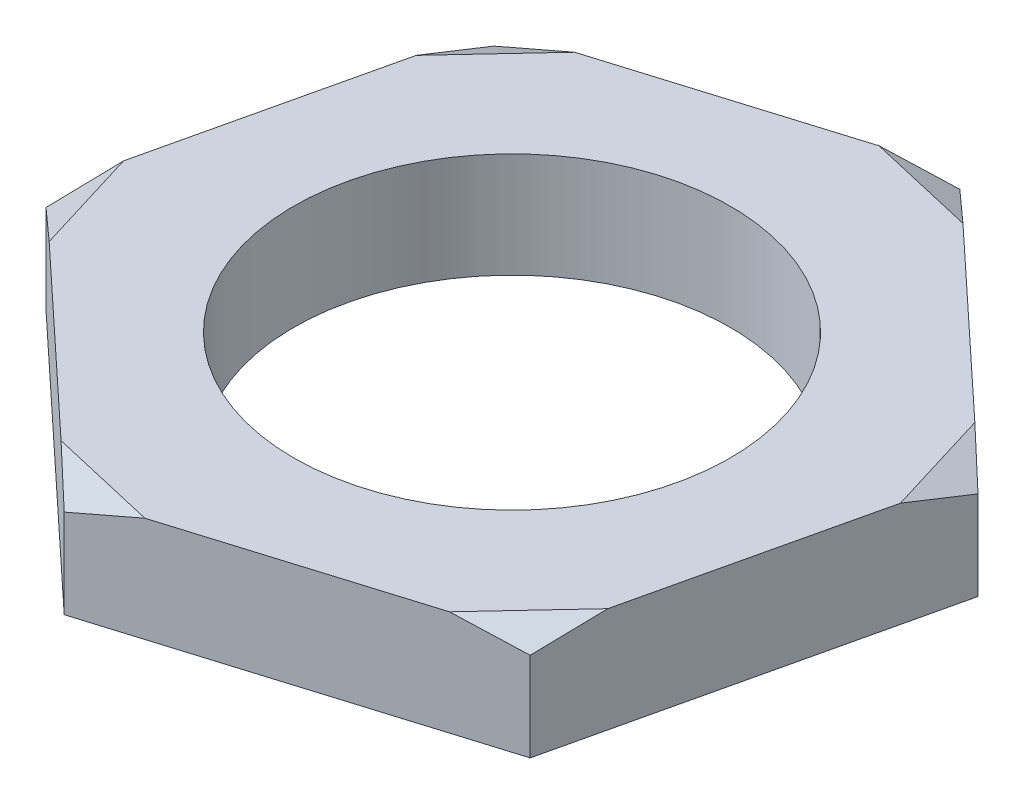
ISO-10303-21;
HEADER;
FILE_DESCRIPTION(('STEP AP214'),'2;1');
FILE_NAME('part.step','',(''),(''),'','','');
FILE_SCHEMA(('AUTOMOTIVE_DESIGN { 1 0 10303 214 1 1 1 1 }'));
ENDSEC;
DATA;
#1=APPLICATION_CONTEXT('core data for automotive mechanical design processes');
#2=APPLICATION_PROTOCOL_DEFINITION('international standard','automotive_design',2000,#1);
#3=PRODUCT_CONTEXT('',#1,'mechanical');
#4=PRODUCT('Part','Part','',(#3));
#5=PRODUCT_RELATED_PRODUCT_CATEGORY('part','',(#4));
#6=PRODUCT_DEFINITION_FORMATION('','',#4);
#7=PRODUCT_DEFINITION_CONTEXT('part definition',#1,'design');
#8=PRODUCT_DEFINITION('design','',#6,#7);
#9=PRODUCT_DEFINITION_SHAPE('','',#8);
#10=(LENGTH_UNIT() NAMED_UNIT(*) SI_UNIT(.MILLI.,.METRE.));
#11=(NAMED_UNIT(*) PLANE_ANGLE_UNIT() SI_UNIT($,.RADIAN.));
#12=(NAMED_UNIT(*) SI_UNIT($,.STERADIAN.) SOLID_ANGLE_UNIT());
#13=UNCERTAINTY_MEASURE_WITH_UNIT(LENGTH_MEASURE(1.E-05),#10,'distance_accuracy_value','');
#14=(GEOMETRIC_REPRESENTATION_CONTEXT(3) GLOBAL_UNCERTAINTY_ASSIGNED_CONTEXT((#13)) GLOBAL_UNIT_ASSIGNED_CONTEXT((#10,
#11,#12)) REPRESENTATION_CONTEXT('',''));
#15=CARTESIAN_POINT('',(0.,0.,0.));
#16=DIRECTION('',(0.,0.,1.));
#17=DIRECTION('',(1.,0.,0.));
#18=AXIS2_PLACEMENT_3D('',#15,#16,#17);
#19=CARTESIAN_POINT('',(0.,1.3,0.));
#20=DIRECTION('',(0.,1.,0.));
#21=DIRECTION('',(0.,0.,1.));
#22=AXIS2_PLACEMENT_3D('',#19,#20,#21);
#23=PLANE('',#22);
#24=CARTESIAN_POINT('',(0.,1.3,0.));
#25=DIRECTION('',(0.,1.,0.));
#26=DIRECTION('',(0.,0.,1.));
#27=AXIS2_PLACEMENT_3D('',#24,#25,#26);
#28=CIRCLE('',#27,2.7);
#29=CARTESIAN_POINT('',(0.,1.3,2.7));
#30=VERTEX_POINT('',#29);
#31=EDGE_CURVE('E204',#30,#30,#28,.T.);
#32=ORIENTED_EDGE('',*,*,#31,.F.);
#33=EDGE_LOOP('',(#32));
#34=FACE_BOUND('',#33,.T.);
#35=DIRECTION('',(-0.731076522641748,0.,-0.682295477078699));
#36=VECTOR('',#35,1.);
#37=CARTESIAN_POINT('',(4.41753081689651,1.3,-1.34861218113399));
#38=LINE('',#37,#36);
#39=CARTESIAN_POINT('',(3.83266959878311,1.3,-1.89444856279695));
#40=VERTEX_POINT('',#39);
#41=CARTESIAN_POINT('',(1.62569421784648,1.3,-3.95416361833704));
#42=VERTEX_POINT('',#41);
#43=EDGE_CURVE('E126',#40,#42,#38,.T.);
#44=ORIENTED_EDGE('',*,*,#43,.T.);
#45=DIRECTION('',(-0.974278579257493,0.,-0.225346954716502));
#46=VECTOR('',#45,1.);
#47=CARTESIAN_POINT('',(0.950694217846479,1.3,-4.110288568297));
#48=LINE('',#47,#46);
#49=CARTESIAN_POINT('',(0.275694217846484,1.3,-4.26641351825697));
#50=VERTEX_POINT('',#49);
#51=EDGE_CURVE('E41',#42,#50,#48,.T.);
#52=ORIENTED_EDGE('',*,*,#51,.T.);
#53=DIRECTION('',(-0.956423477358251,0.,0.291983102178794));
#54=VECTOR('',#53,1.);
#55=CARTESIAN_POINT('',(1.04083299973308,1.3,-4.5));
#56=LINE('',#55,#54);
#57=CARTESIAN_POINT('',(-2.61155903527684,1.3,-3.38497430060904));
#58=VERTEX_POINT('',#57);
#59=EDGE_CURVE('E131',#50,#58,#56,.T.);
#60=ORIENTED_EDGE('',*,*,#59,.T.);
#61=DIRECTION('',(0.682295477078699,0.,-0.731076522641749));
#62=VECTOR('',#61,1.);
#63=CARTESIAN_POINT('',(-3.08426720810674,1.3,-2.87846962803453));
#64=LINE('',#63,#62);
#65=CARTESIAN_POINT('',(-3.55697538093663,1.3,-2.37196495546002));
#66=VERTEX_POINT('',#65);
#67=EDGE_CURVE('E141',#66,#58,#64,.T.);
#68=ORIENTED_EDGE('',*,*,#67,.F.);
#69=DIRECTION('',(-0.225346954716502,0.,0.974278579257493));
#70=VECTOR('',#69,1.);
#71=CARTESIAN_POINT('',(-3.37669781716343,1.3,-3.15138781886601));
#72=LINE('',#71,#70);
#73=CARTESIAN_POINT('',(-4.23725325312331,1.3,0.569189317727997));
#74=VERTEX_POINT('',#73);
#75=EDGE_CURVE('E213',#66,#74,#72,.T.);
#76=ORIENTED_EDGE('',*,*,#75,.T.);
#77=DIRECTION('',(0.291983102178794,0.,0.95642347735825));
#78=VECTOR('',#77,1.);
#79=CARTESIAN_POINT('',(-4.03496142595321,1.3,1.23181894026247));
#80=LINE('',#79,#78);
#81=CARTESIAN_POINT('',(-3.83266959878311,1.3,1.89444856279695));
#82=VERTEX_POINT('',#81);
#83=EDGE_CURVE('E150',#74,#82,#80,.T.);
#84=ORIENTED_EDGE('',*,*,#83,.T.);
#85=DIRECTION('',(0.731076522641748,0.,0.682295477078699));
#86=VECTOR('',#85,1.);
#87=CARTESIAN_POINT('',(-4.41753081689651,1.3,1.34861218113399));
#88=LINE('',#87,#86);
#89=CARTESIAN_POINT('',(-1.62569421784647,1.3,3.95416361833704));
#90=VERTEX_POINT('',#89);
#91=EDGE_CURVE('E211',#82,#90,#88,.T.);
#92=ORIENTED_EDGE('',*,*,#91,.T.);
#93=DIRECTION('',(0.974278579257493,0.,0.225346954716502));
#94=VECTOR('',#93,1.);
#95=CARTESIAN_POINT('',(-0.950694217846479,1.3,4.110288568297));
#96=LINE('',#95,#94);
#97=CARTESIAN_POINT('',(-0.275694217846482,1.3,4.26641351825697));
#98=VERTEX_POINT('',#97);
#99=EDGE_CURVE('E159',#90,#98,#96,.T.);
#100=ORIENTED_EDGE('',*,*,#99,.T.);
#101=DIRECTION('',(0.956423477358251,0.,-0.291983102178794));
#102=VECTOR('',#101,1.);
#103=CARTESIAN_POINT('',(-1.04083299973308,1.3,4.5));
#104=LINE('',#103,#102);
#105=CARTESIAN_POINT('',(2.61155903527683,1.3,3.38497430060905));
#106=VERTEX_POINT('',#105);
#107=EDGE_CURVE('E209',#98,#106,#104,.T.);
#108=ORIENTED_EDGE('',*,*,#107,.T.);
#109=DIRECTION('',(0.682295477078699,0.,-0.731076522641748));
#110=VECTOR('',#109,1.);
#111=CARTESIAN_POINT('',(3.08426720810673,1.3,2.87846962803453));
#112=LINE('',#111,#110);
#113=CARTESIAN_POINT('',(3.55697538093664,1.3,2.37196495546001));
#114=VERTEX_POINT('',#113);
#115=EDGE_CURVE('E177',#106,#114,#112,.T.);
#116=ORIENTED_EDGE('',*,*,#115,.T.);
#117=DIRECTION('',(0.225346954716502,0.,-0.974278579257493));
#118=VECTOR('',#117,1.);
#119=CARTESIAN_POINT('',(3.37669781716343,1.3,3.15138781886601));
#120=LINE('',#119,#118);
#121=CARTESIAN_POINT('',(4.23725325312331,1.3,-0.569189317727993));
#122=VERTEX_POINT('',#121);
#123=EDGE_CURVE('E206',#114,#122,#120,.T.);
#124=ORIENTED_EDGE('',*,*,#123,.T.);
#125=DIRECTION('',(-0.291983102178794,0.,-0.95642347735825));
#126=VECTOR('',#125,1.);
#127=CARTESIAN_POINT('',(4.03496142595321,1.3,-1.23181894026247));
#128=LINE('',#127,#126);
#129=EDGE_CURVE('E168',#122,#40,#128,.T.);
#130=ORIENTED_EDGE('',*,*,#129,.T.);
#131=EDGE_LOOP('',(#44,#52,#60,#68,#76,#84,#92,#100,#108,#116,#124,#130));
#132=FACE_BOUND('',#131,.T.);
#133=ADVANCED_FACE('F33',(#34,#132),#23,.T.);
#134=CARTESIAN_POINT('',(-3.37669781716343,1.3,-3.15138781886601));
#135=DIRECTION('',(0.974278579257493,0.,0.225346954716502));
#136=DIRECTION('',(0.225346954716502,0.,-0.974278579257493));
#137=AXIS2_PLACEMENT_3D('',#134,#135,#136);
#138=PLANE('',#137);
#139=ORIENTED_EDGE('',*,*,#75,.F.);
#140=DIRECTION('',(0.218618658048804,-0.242535625036333,-0.945189056718906));
#141=VECTOR('',#140,1.);
#142=CARTESIAN_POINT('',(-3.38730237973833,1.11176470588235,-3.10553941513625));
#143=LINE('',#142,#141);
#144=CARTESIAN_POINT('',(-3.37669781716343,1.1,-3.15138781886601));
#145=VERTEX_POINT('',#144);
#146=EDGE_CURVE('E133',#66,#145,#143,.T.);
#147=ORIENTED_EDGE('',*,*,#146,.T.);
#148=DIRECTION('',(0.,-1.,0.));
#149=VECTOR('',#148,1.);
#150=CARTESIAN_POINT('',(-3.37669781716343,1.3,-3.15138781886601));
#151=LINE('',#150,#149);
#152=CARTESIAN_POINT('',(-3.37669781716343,0.,-3.15138781886601));
#153=VERTEX_POINT('',#152);
#154=EDGE_CURVE('E180',#145,#153,#151,.T.);
#155=ORIENTED_EDGE('',*,*,#154,.T.);
#156=DIRECTION('',(-0.225346954716502,0.,0.974278579257493));
#157=VECTOR('',#156,1.);
#158=CARTESIAN_POINT('',(-3.37669781716343,0.,-3.15138781886601));
#159=LINE('',#158,#157);
#160=CARTESIAN_POINT('',(-4.41753081689651,0.,1.34861218113399));
#161=VERTEX_POINT('',#160);
#162=EDGE_CURVE('E199',#153,#161,#159,.T.);
#163=ORIENTED_EDGE('',*,*,#162,.T.);
#164=DIRECTION('',(0.,-1.,0.));
#165=VECTOR('',#164,1.);
#166=CARTESIAN_POINT('',(-4.41753081689651,1.3,1.34861218113399));
#167=LINE('',#166,#165);
#168=CARTESIAN_POINT('',(-4.41753081689651,1.1,1.34861218113399));
#169=VERTEX_POINT('',#168);
#170=EDGE_CURVE('E182',#169,#161,#167,.T.);
#171=ORIENTED_EDGE('',*,*,#170,.F.);
#172=DIRECTION('',(-0.218618658048804,-0.242535625036333,0.945189056718906));
#173=VECTOR('',#172,1.);
#174=CARTESIAN_POINT('',(-3.42731872516107,2.19854168318047,-2.93253034024283));
#175=LINE('',#174,#173);
#176=EDGE_CURVE('E147',#74,#169,#175,.T.);
#177=ORIENTED_EDGE('',*,*,#176,.F.);
#178=EDGE_LOOP('',(#139,#147,#155,#163,#171,#177));
#179=FACE_BOUND('',#178,.T.);
#180=ADVANCED_FACE('F226',(#179),#138,.F.);
#181=CARTESIAN_POINT('',(1.04083299973308,1.3,-4.5));
#182=DIRECTION('',(0.291983102178794,0.,0.956423477358251));
#183=DIRECTION('',(0.956423477358251,0.,-0.291983102178794));
#184=AXIS2_PLACEMENT_3D('',#181,#182,#183);
#185=PLANE('',#184);
#186=DIRECTION('',(-0.927867063522025,0.242535625036333,0.283265216747925));
#187=VECTOR('',#186,1.);
#188=CARTESIAN_POINT('',(0.995824836092694,1.11176470588235,-4.486259618721));
#189=LINE('',#188,#187);
#190=CARTESIAN_POINT('',(1.04083299973308,1.1,-4.5));
#191=VERTEX_POINT('',#190);
#192=EDGE_CURVE('E129',#191,#50,#189,.T.);
#193=ORIENTED_EDGE('',*,*,#192,.F.);
#194=DIRECTION('',(0.,-1.,0.));
#195=VECTOR('',#194,1.);
#196=CARTESIAN_POINT('',(1.04083299973308,1.3,-4.5));
#197=LINE('',#196,#195);
#198=CARTESIAN_POINT('',(1.04083299973308,0.,-4.5));
#199=VERTEX_POINT('',#198);
#200=EDGE_CURVE('E117',#191,#199,#197,.T.);
#201=ORIENTED_EDGE('',*,*,#200,.T.);
#202=DIRECTION('',(-0.956423477358251,0.,0.291983102178794));
#203=VECTOR('',#202,1.);
#204=CARTESIAN_POINT('',(1.04083299973308,0.,-4.5));
#205=LINE('',#204,#203);
#206=EDGE_CURVE('E202',#199,#153,#205,.T.);
#207=ORIENTED_EDGE('',*,*,#206,.T.);
#208=ORIENTED_EDGE('',*,*,#154,.F.);
#209=DIRECTION('',(0.927867063522025,0.242535625036333,-0.283265216747925));
#210=VECTOR('',#209,1.);
#211=CARTESIAN_POINT('',(0.825986409438381,2.19854168318047,-4.434410252977));
#212=LINE('',#211,#210);
#213=EDGE_CURVE('E139',#145,#58,#212,.T.);
#214=ORIENTED_EDGE('',*,*,#213,.T.);
#215=ORIENTED_EDGE('',*,*,#59,.F.);
#216=EDGE_LOOP('',(#193,#201,#207,#208,#214,#215));
#217=FACE_BOUND('',#216,.T.);
#218=ADVANCED_FACE('F35',(#217),#185,.F.);
#219=CARTESIAN_POINT('',(0.,0.,0.));
#220=DIRECTION('',(0.,1.,0.));
#221=DIRECTION('',(0.,0.,1.));
#222=AXIS2_PLACEMENT_3D('',#219,#220,#221);
#223=PLANE('',#222);
#224=ORIENTED_EDGE('',*,*,#206,.F.);
#225=DIRECTION('',(-0.731076522641748,0.,-0.682295477078699));
#226=VECTOR('',#225,1.);
#227=CARTESIAN_POINT('',(4.41753081689651,0.,-1.34861218113399));
#228=LINE('',#227,#226);
#229=CARTESIAN_POINT('',(4.41753081689651,0.,-1.34861218113399));
#230=VERTEX_POINT('',#229);
#231=EDGE_CURVE('E121',#230,#199,#228,.T.);
#232=ORIENTED_EDGE('',*,*,#231,.F.);
#233=DIRECTION('',(0.225346954716502,0.,-0.974278579257493));
#234=VECTOR('',#233,1.);
#235=CARTESIAN_POINT('',(3.37669781716343,0.,3.15138781886601));
#236=LINE('',#235,#234);
#237=CARTESIAN_POINT('',(3.37669781716343,0.,3.15138781886601));
#238=VERTEX_POINT('',#237);
#239=EDGE_CURVE('E190',#238,#230,#236,.T.);
#240=ORIENTED_EDGE('',*,*,#239,.F.);
#241=DIRECTION('',(0.956423477358251,0.,-0.291983102178794));
#242=VECTOR('',#241,1.);
#243=CARTESIAN_POINT('',(-1.04083299973308,0.,4.5));
#244=LINE('',#243,#242);
#245=CARTESIAN_POINT('',(-1.04083299973308,0.,4.5));
#246=VERTEX_POINT('',#245);
#247=EDGE_CURVE('E193',#246,#238,#244,.T.);
#248=ORIENTED_EDGE('',*,*,#247,.F.);
#249=DIRECTION('',(0.731076522641748,0.,0.682295477078699));
#250=VECTOR('',#249,1.);
#251=CARTESIAN_POINT('',(-4.41753081689651,0.,1.34861218113399));
#252=LINE('',#251,#250);
#253=EDGE_CURVE('E196',#161,#246,#252,.T.);
#254=ORIENTED_EDGE('',*,*,#253,.F.);
#255=ORIENTED_EDGE('',*,*,#162,.F.);
#256=EDGE_LOOP('',(#224,#232,#240,#248,#254,#255));
#257=FACE_BOUND('',#256,.T.);
#258=CARTESIAN_POINT('',(0.,0.,0.));
#259=DIRECTION('',(0.,1.,0.));
#260=DIRECTION('',(0.,0.,1.));
#261=AXIS2_PLACEMENT_3D('',#258,#259,#260);
#262=CIRCLE('',#261,2.7);
#263=CARTESIAN_POINT('',(0.,0.,2.7));
#264=VERTEX_POINT('',#263);
#265=EDGE_CURVE('E216',#264,#264,#262,.T.);
#266=ORIENTED_EDGE('',*,*,#265,.T.);
#267=EDGE_LOOP('',(#266));
#268=FACE_BOUND('',#267,.T.);
#269=ADVANCED_FACE('F252',(#257,#268),#223,.F.);
#270=CARTESIAN_POINT('',(-4.41753081689651,1.3,1.34861218113399));
#271=DIRECTION('',(0.682295477078699,0.,-0.731076522641748));
#272=DIRECTION('',(-0.731076522641748,0.,-0.682295477078699));
#273=AXIS2_PLACEMENT_3D('',#270,#271,#272);
#274=PLANE('',#273);
#275=DIRECTION('',(0.709248405473221,0.242535625036333,0.661923839970981));
#276=VECTOR('',#275,1.);
#277=CARTESIAN_POINT('',(-4.38312721583102,1.11176470588235,1.38072020358475));
#278=LINE('',#277,#276);
#279=EDGE_CURVE('E144',#169,#82,#278,.T.);
#280=ORIENTED_EDGE('',*,*,#279,.F.);
#281=ORIENTED_EDGE('',*,*,#170,.T.);
#282=ORIENTED_EDGE('',*,*,#253,.T.);
#283=DIRECTION('',(0.,-1.,0.));
#284=VECTOR('',#283,1.);
#285=CARTESIAN_POINT('',(-1.04083299973308,1.3,4.5));
#286=LINE('',#285,#284);
#287=CARTESIAN_POINT('',(-1.04083299973308,1.1,4.5));
#288=VERTEX_POINT('',#287);
#289=EDGE_CURVE('E184',#288,#246,#286,.T.);
#290=ORIENTED_EDGE('',*,*,#289,.F.);
#291=DIRECTION('',(0.709248405473221,-0.242535625036333,0.661923839970981));
#292=VECTOR('',#291,1.);
#293=CARTESIAN_POINT('',(-4.25330513459945,2.19854168318047,1.50187991273417));
#294=LINE('',#293,#292);
#295=EDGE_CURVE('E156',#90,#288,#294,.T.);
#296=ORIENTED_EDGE('',*,*,#295,.F.);
#297=ORIENTED_EDGE('',*,*,#91,.F.);
#298=EDGE_LOOP('',(#280,#281,#282,#290,#296,#297));
#299=FACE_BOUND('',#298,.T.);
#300=ADVANCED_FACE('F255',(#299),#274,.F.);
#301=CARTESIAN_POINT('',(-1.04083299973308,1.3,4.5));
#302=DIRECTION('',(-0.291983102178794,0.,-0.956423477358251));
#303=DIRECTION('',(-0.956423477358251,0.,0.291983102178794));
#304=AXIS2_PLACEMENT_3D('',#301,#302,#303);
#305=PLANE('',#304);
#306=DIRECTION('',(0.927867063522025,0.242535625036333,-0.283265216747925));
#307=VECTOR('',#306,1.);
#308=CARTESIAN_POINT('',(-0.995824836092691,1.11176470588235,4.486259618721));
#309=LINE('',#308,#307);
#310=EDGE_CURVE('E153',#288,#98,#309,.T.);
#311=ORIENTED_EDGE('',*,*,#310,.F.);
#312=ORIENTED_EDGE('',*,*,#289,.T.);
#313=ORIENTED_EDGE('',*,*,#247,.T.);
#314=DIRECTION('',(0.,-1.,0.));
#315=VECTOR('',#314,1.);
#316=CARTESIAN_POINT('',(3.37669781716343,1.3,3.15138781886601));
#317=LINE('',#316,#315);
#318=CARTESIAN_POINT('',(3.37669781716343,1.1,3.15138781886601));
#319=VERTEX_POINT('',#318);
#320=EDGE_CURVE('E186',#319,#238,#317,.T.);
#321=ORIENTED_EDGE('',*,*,#320,.F.);
#322=DIRECTION('',(0.927867063522025,-0.242535625036333,-0.283265216747925));
#323=VECTOR('',#322,1.);
#324=CARTESIAN_POINT('',(-0.825986409438379,2.19854168318047,4.434410252977));
#325=LINE('',#324,#323);
#326=EDGE_CURVE('E174',#106,#319,#325,.T.);
#327=ORIENTED_EDGE('',*,*,#326,.F.);
#328=ORIENTED_EDGE('',*,*,#107,.F.);
#329=EDGE_LOOP('',(#311,#312,#313,#321,#327,#328));
#330=FACE_BOUND('',#329,.T.);
#331=ADVANCED_FACE('F261',(#330),#305,.F.);
#332=CARTESIAN_POINT('',(3.37669781716343,1.3,3.15138781886601));
#333=DIRECTION('',(-0.974278579257493,0.,-0.225346954716502));
#334=DIRECTION('',(-0.225346954716502,0.,0.974278579257493));
#335=AXIS2_PLACEMENT_3D('',#332,#333,#334);
#336=PLANE('',#335);
#337=DIRECTION('',(0.218618658048804,-0.242535625036333,-0.945189056718906));
#338=VECTOR('',#337,1.);
#339=CARTESIAN_POINT('',(3.42731872516107,2.19854168318047,2.93253034024284));
#340=LINE('',#339,#338);
#341=CARTESIAN_POINT('',(4.41753081689651,1.1,-1.34861218113399));
#342=VERTEX_POINT('',#341);
#343=EDGE_CURVE('E165',#122,#342,#340,.T.);
#344=ORIENTED_EDGE('',*,*,#343,.F.);
#345=ORIENTED_EDGE('',*,*,#123,.F.);
#346=DIRECTION('',(0.218618658048804,0.242535625036333,-0.945189056718906));
#347=VECTOR('',#346,1.);
#348=CARTESIAN_POINT('',(3.38730237973833,1.11176470588235,3.10553941513625));
#349=LINE('',#348,#347);
#350=EDGE_CURVE('E171',#319,#114,#349,.T.);
#351=ORIENTED_EDGE('',*,*,#350,.F.);
#352=ORIENTED_EDGE('',*,*,#320,.T.);
#353=ORIENTED_EDGE('',*,*,#239,.T.);
#354=DIRECTION('',(0.,-1.,0.));
#355=VECTOR('',#354,1.);
#356=CARTESIAN_POINT('',(4.41753081689651,1.3,-1.34861218113399));
#357=LINE('',#356,#355);
#358=EDGE_CURVE('E125',#342,#230,#357,.T.);
#359=ORIENTED_EDGE('',*,*,#358,.F.);
#360=EDGE_LOOP('',(#344,#345,#351,#352,#353,#359));
#361=FACE_BOUND('',#360,.T.);
#362=ADVANCED_FACE('F232',(#361),#336,.F.);
#363=CARTESIAN_POINT('',(4.41753081689651,1.3,-1.34861218113399));
#364=DIRECTION('',(-0.682295477078699,0.,0.731076522641748));
#365=DIRECTION('',(0.731076522641748,0.,0.682295477078699));
#366=AXIS2_PLACEMENT_3D('',#363,#364,#365);
#367=PLANE('',#366);
#368=DIRECTION('',(-0.709248405473221,-0.242535625036333,-0.661923839970981));
#369=VECTOR('',#368,1.);
#370=CARTESIAN_POINT('',(4.25330513459945,2.19854168318047,-1.50187991273417));
#371=LINE('',#370,#369);
#372=EDGE_CURVE('E11',#42,#191,#371,.T.);
#373=ORIENTED_EDGE('',*,*,#372,.F.);
#374=ORIENTED_EDGE('',*,*,#43,.F.);
#375=DIRECTION('',(-0.709248405473221,0.242535625036333,-0.661923839970981));
#376=VECTOR('',#375,1.);
#377=CARTESIAN_POINT('',(4.38312721583102,1.11176470588235,-1.38072020358475));
#378=LINE('',#377,#376);
#379=EDGE_CURVE('E162',#342,#40,#378,.T.);
#380=ORIENTED_EDGE('',*,*,#379,.F.);
#381=ORIENTED_EDGE('',*,*,#358,.T.);
#382=ORIENTED_EDGE('',*,*,#231,.T.);
#383=ORIENTED_EDGE('',*,*,#200,.F.);
#384=EDGE_LOOP('',(#373,#374,#380,#381,#382,#383));
#385=FACE_BOUND('',#384,.T.);
#386=ADVANCED_FACE('F119',(#385),#367,.F.);
#387=CARTESIAN_POINT('',(0.,1.3,0.));
#388=DIRECTION('',(0.,-1.,0.));
#389=DIRECTION('',(0.,0.,-1.));
#390=AXIS2_PLACEMENT_3D('',#387,#388,#389);
#391=CYLINDRICAL_SURFACE('',#390,2.7);
#392=ORIENTED_EDGE('',*,*,#31,.T.);
#393=EDGE_LOOP('',(#392));
#394=FACE_BOUND('',#393,.T.);
#395=ORIENTED_EDGE('',*,*,#265,.F.);
#396=EDGE_LOOP('',(#395));
#397=FACE_BOUND('',#396,.T.);
#398=ADVANCED_FACE('F222',(#394,#397),#391,.F.);
#399=CARTESIAN_POINT('',(0.997013233395055,2.7275208614068,0.930487573687829));
#400=DIRECTION('',(0.326947360276222,0.894427190999916,0.305131813497724));
#401=DIRECTION('',(-0.939218397901731,0.343320260169576,0.));
#402=AXIS2_PLACEMENT_3D('',#399,#400,#401);
#403=PLANE('',#402);
#404=ORIENTED_EDGE('',*,*,#115,.F.);
#405=ORIENTED_EDGE('',*,*,#326,.T.);
#406=ORIENTED_EDGE('',*,*,#350,.T.);
#407=EDGE_LOOP('',(#404,#405,#406));
#408=FACE_BOUND('',#407,.T.);
#409=ADVANCED_FACE('F237',(#408),#403,.T.);
#410=CARTESIAN_POINT('',(1.30433249341693,2.7275208614068,-0.398195001185467));
#411=DIRECTION('',(0.427725582129956,0.894427190999916,-0.13057881295061));
#412=DIRECTION('',(-0.902151472984943,0.431419424448063,0.));
#413=AXIS2_PLACEMENT_3D('',#410,#411,#412);
#414=PLANE('',#413);
#415=ORIENTED_EDGE('',*,*,#129,.F.);
#416=ORIENTED_EDGE('',*,*,#343,.T.);
#417=ORIENTED_EDGE('',*,*,#379,.T.);
#418=EDGE_LOOP('',(#415,#416,#417));
#419=FACE_BOUND('',#418,.T.);
#420=ADVANCED_FACE('F234',(#419),#414,.T.);
#421=CARTESIAN_POINT('',(-0.307319260021877,2.7275208614068,1.3286825748733));
#422=DIRECTION('',(-0.100778221853733,0.894427190999916,0.435710626448334));
#423=DIRECTION('',(0.,-0.437940217130813,0.899004096886892));
#424=AXIS2_PLACEMENT_3D('',#421,#422,#423);
#425=PLANE('',#424);
#426=ORIENTED_EDGE('',*,*,#99,.F.);
#427=ORIENTED_EDGE('',*,*,#295,.T.);
#428=ORIENTED_EDGE('',*,*,#310,.T.);
#429=EDGE_LOOP('',(#426,#427,#428));
#430=FACE_BOUND('',#429,.T.);
#431=ADVANCED_FACE('F236',(#430),#425,.T.);
#432=CARTESIAN_POINT('',(-1.30433249341693,2.7275208614068,0.398195001185467));
#433=DIRECTION('',(-0.427725582129956,0.894427190999916,0.13057881295061));
#434=DIRECTION('',(-0.902151472984943,-0.431419424448063,0.));
#435=AXIS2_PLACEMENT_3D('',#432,#433,#434);
#436=PLANE('',#435);
#437=ORIENTED_EDGE('',*,*,#83,.F.);
#438=ORIENTED_EDGE('',*,*,#176,.T.);
#439=ORIENTED_EDGE('',*,*,#279,.T.);
#440=EDGE_LOOP('',(#437,#438,#439));
#441=FACE_BOUND('',#440,.T.);
#442=ADVANCED_FACE('F243',(#441),#436,.T.);
#443=CARTESIAN_POINT('',(-0.997013233395056,2.7275208614068,-0.930487573687829));
#444=DIRECTION('',(0.326947360276223,-0.894427190999916,0.305131813497724));
#445=DIRECTION('',(0.939218397901731,0.343320260169576,0.));
#446=AXIS2_PLACEMENT_3D('',#443,#444,#445);
#447=PLANE('',#446);
#448=ORIENTED_EDGE('',*,*,#146,.F.);
#449=ORIENTED_EDGE('',*,*,#67,.T.);
#450=ORIENTED_EDGE('',*,*,#213,.F.);
#451=EDGE_LOOP('',(#448,#449,#450));
#452=FACE_BOUND('',#451,.T.);
#453=ADVANCED_FACE('F279',(#452),#447,.F.);
#454=CARTESIAN_POINT('',(0.307319260021877,2.7275208614068,-1.3286825748733));
#455=DIRECTION('',(0.100778221853733,0.894427190999916,-0.435710626448334));
#456=DIRECTION('',(0.,0.437940217130813,0.899004096886892));
#457=AXIS2_PLACEMENT_3D('',#454,#455,#456);
#458=PLANE('',#457);
#459=ORIENTED_EDGE('',*,*,#372,.T.);
#460=ORIENTED_EDGE('',*,*,#192,.T.);
#461=ORIENTED_EDGE('',*,*,#51,.F.);
#462=EDGE_LOOP('',(#459,#460,#461));
#463=FACE_BOUND('',#462,.T.);
#464=ADVANCED_FACE('F135',(#463),#458,.T.);
#465=CLOSED_SHELL('',(#133,#180,#218,#269,#300,#331,#362,#386,#398,#409,#420,#431,#442,#453,#464));
#466=MANIFOLD_SOLID_BREP('B2',#465);
#467=ADVANCED_BREP_SHAPE_REPRESENTATION('',(#18,#466),#14);
#468=SHAPE_DEFINITION_REPRESENTATION(#9,#467);
ENDSEC;
END-ISO-10303-21;
